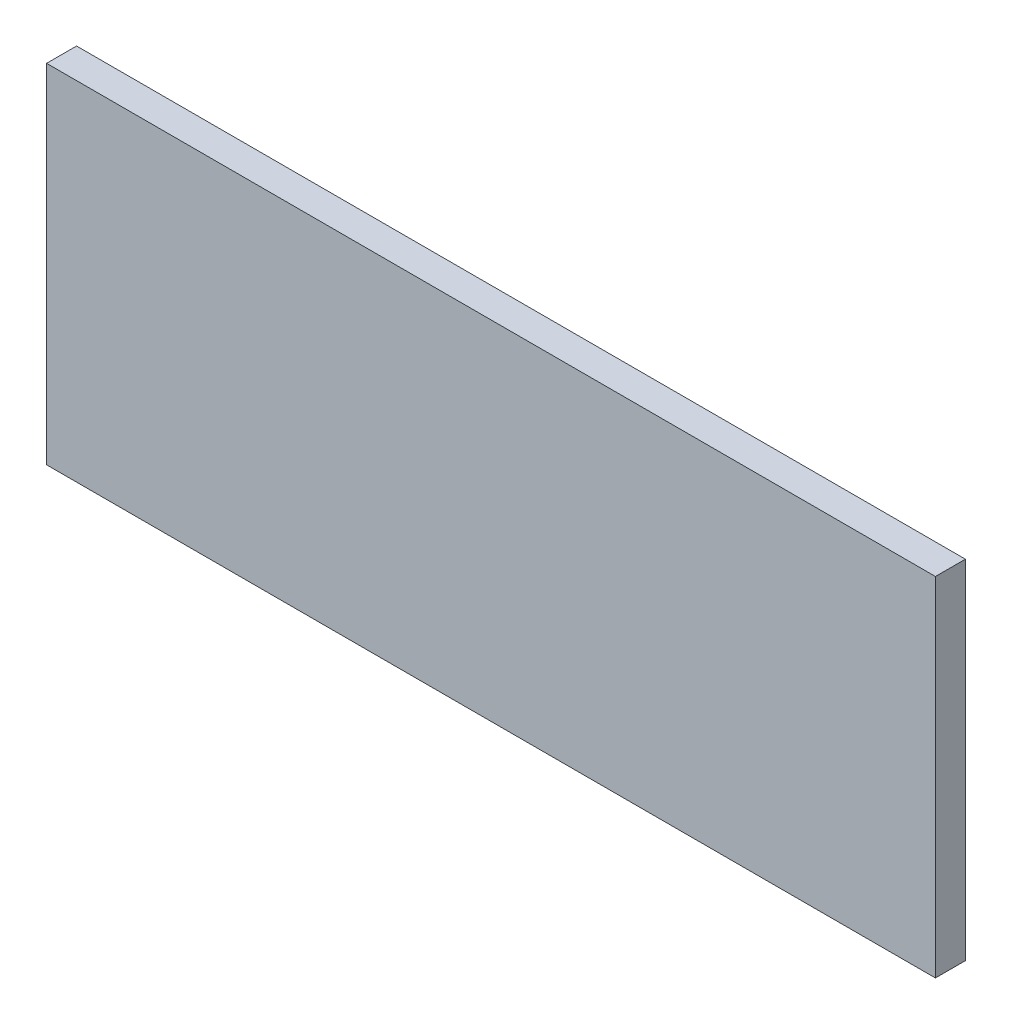
ISO-10303-21;
HEADER;
FILE_DESCRIPTION(('STEP AP214'),'2;1');
FILE_NAME('part.step','',(''),(''),'','','');
FILE_SCHEMA(('AUTOMOTIVE_DESIGN { 1 0 10303 214 1 1 1 1 }'));
ENDSEC;
DATA;
#1=APPLICATION_CONTEXT('core data for automotive mechanical design processes');
#2=APPLICATION_PROTOCOL_DEFINITION('international standard','automotive_design',2000,#1);
#3=PRODUCT_CONTEXT('',#1,'mechanical');
#4=PRODUCT('Part','Part','',(#3));
#5=PRODUCT_RELATED_PRODUCT_CATEGORY('part','',(#4));
#6=PRODUCT_DEFINITION_FORMATION('','',#4);
#7=PRODUCT_DEFINITION_CONTEXT('part definition',#1,'design');
#8=PRODUCT_DEFINITION('design','',#6,#7);
#9=PRODUCT_DEFINITION_SHAPE('','',#8);
#10=(LENGTH_UNIT() NAMED_UNIT(*) SI_UNIT(.MILLI.,.METRE.));
#11=(NAMED_UNIT(*) PLANE_ANGLE_UNIT() SI_UNIT($,.RADIAN.));
#12=(NAMED_UNIT(*) SI_UNIT($,.STERADIAN.) SOLID_ANGLE_UNIT());
#13=UNCERTAINTY_MEASURE_WITH_UNIT(LENGTH_MEASURE(1.E-05),#10,'distance_accuracy_value','');
#14=(GEOMETRIC_REPRESENTATION_CONTEXT(3) GLOBAL_UNCERTAINTY_ASSIGNED_CONTEXT((#13)) GLOBAL_UNIT_ASSIGNED_CONTEXT((#10,
#11,#12)) REPRESENTATION_CONTEXT('',''));
#15=CARTESIAN_POINT('',(0.,0.,0.));
#16=DIRECTION('',(0.,0.,1.));
#17=DIRECTION('',(1.,0.,0.));
#18=AXIS2_PLACEMENT_3D('',#15,#16,#17);
#19=CARTESIAN_POINT('',(148.25,58.,5.));
#20=DIRECTION('',(-1.,0.,0.));
#21=DIRECTION('',(0.,0.,1.));
#22=AXIS2_PLACEMENT_3D('',#19,#20,#21);
#23=PLANE('',#22);
#24=DIRECTION('',(0.,1.,0.));
#25=VECTOR('',#24,1.);
#26=CARTESIAN_POINT('',(148.25,58.,-5.));
#27=LINE('',#26,#25);
#28=CARTESIAN_POINT('',(148.25,-58.,-5.));
#29=VERTEX_POINT('',#28);
#30=CARTESIAN_POINT('',(148.25,58.,-5.));
#31=VERTEX_POINT('',#30);
#32=EDGE_CURVE('E100',#29,#31,#27,.T.);
#33=ORIENTED_EDGE('',*,*,#32,.T.);
#34=DIRECTION('',(0.,0.,-1.));
#35=VECTOR('',#34,1.);
#36=CARTESIAN_POINT('',(148.25,58.,5.));
#37=LINE('',#36,#35);
#38=CARTESIAN_POINT('',(148.25,58.,5.));
#39=VERTEX_POINT('',#38);
#40=EDGE_CURVE('E11',#39,#31,#37,.T.);
#41=ORIENTED_EDGE('',*,*,#40,.F.);
#42=DIRECTION('',(0.,1.,0.));
#43=VECTOR('',#42,1.);
#44=CARTESIAN_POINT('',(148.25,58.,5.));
#45=LINE('',#44,#43);
#46=CARTESIAN_POINT('',(148.25,-58.,5.));
#47=VERTEX_POINT('',#46);
#48=EDGE_CURVE('E88',#47,#39,#45,.T.);
#49=ORIENTED_EDGE('',*,*,#48,.F.);
#50=DIRECTION('',(0.,0.,-1.));
#51=VECTOR('',#50,1.);
#52=CARTESIAN_POINT('',(148.25,-58.,5.));
#53=LINE('',#52,#51);
#54=EDGE_CURVE('E96',#47,#29,#53,.T.);
#55=ORIENTED_EDGE('',*,*,#54,.T.);
#56=EDGE_LOOP('',(#33,#41,#49,#55));
#57=FACE_BOUND('',#56,.T.);
#58=ADVANCED_FACE('F37',(#57),#23,.F.);
#59=CARTESIAN_POINT('',(-148.25,58.,5.));
#60=DIRECTION('',(0.,-1.,0.));
#61=DIRECTION('',(0.,0.,-1.));
#62=AXIS2_PLACEMENT_3D('',#59,#60,#61);
#63=PLANE('',#62);
#64=DIRECTION('',(-1.,0.,0.));
#65=VECTOR('',#64,1.);
#66=CARTESIAN_POINT('',(-148.25,58.,-5.));
#67=LINE('',#66,#65);
#68=CARTESIAN_POINT('',(-148.25,58.,-5.));
#69=VERTEX_POINT('',#68);
#70=EDGE_CURVE('E92',#31,#69,#67,.T.);
#71=ORIENTED_EDGE('',*,*,#70,.T.);
#72=DIRECTION('',(0.,0.,-1.));
#73=VECTOR('',#72,1.);
#74=CARTESIAN_POINT('',(-148.25,58.,5.));
#75=LINE('',#74,#73);
#76=CARTESIAN_POINT('',(-148.25,58.,5.));
#77=VERTEX_POINT('',#76);
#78=EDGE_CURVE('E45',#77,#69,#75,.T.);
#79=ORIENTED_EDGE('',*,*,#78,.F.);
#80=DIRECTION('',(-1.,0.,0.));
#81=VECTOR('',#80,1.);
#82=CARTESIAN_POINT('',(-148.25,58.,5.));
#83=LINE('',#82,#81);
#84=EDGE_CURVE('E83',#39,#77,#83,.T.);
#85=ORIENTED_EDGE('',*,*,#84,.F.);
#86=ORIENTED_EDGE('',*,*,#40,.T.);
#87=EDGE_LOOP('',(#71,#79,#85,#86));
#88=FACE_BOUND('',#87,.T.);
#89=ADVANCED_FACE('F91',(#88),#63,.F.);
#90=CARTESIAN_POINT('',(-148.25,58.,5.));
#91=DIRECTION('',(1.,0.,0.));
#92=DIRECTION('',(0.,0.,-1.));
#93=AXIS2_PLACEMENT_3D('',#90,#91,#92);
#94=PLANE('',#93);
#95=DIRECTION('',(0.,-1.,0.));
#96=VECTOR('',#95,1.);
#97=CARTESIAN_POINT('',(-148.25,58.,-5.));
#98=LINE('',#97,#96);
#99=CARTESIAN_POINT('',(-148.25,-58.,-5.));
#100=VERTEX_POINT('',#99);
#101=EDGE_CURVE('E70',#69,#100,#98,.T.);
#102=ORIENTED_EDGE('',*,*,#101,.T.);
#103=DIRECTION('',(0.,0.,-1.));
#104=VECTOR('',#103,1.);
#105=CARTESIAN_POINT('',(-148.25,-58.,5.));
#106=LINE('',#105,#104);
#107=CARTESIAN_POINT('',(-148.25,-58.,5.));
#108=VERTEX_POINT('',#107);
#109=EDGE_CURVE('E93',#108,#100,#106,.T.);
#110=ORIENTED_EDGE('',*,*,#109,.F.);
#111=DIRECTION('',(0.,-1.,0.));
#112=VECTOR('',#111,1.);
#113=CARTESIAN_POINT('',(-148.25,58.,5.));
#114=LINE('',#113,#112);
#115=EDGE_CURVE('E86',#77,#108,#114,.T.);
#116=ORIENTED_EDGE('',*,*,#115,.F.);
#117=ORIENTED_EDGE('',*,*,#78,.T.);
#118=EDGE_LOOP('',(#102,#110,#116,#117));
#119=FACE_BOUND('',#118,.T.);
#120=ADVANCED_FACE('F94',(#119),#94,.F.);
#121=CARTESIAN_POINT('',(-148.25,-58.,5.));
#122=DIRECTION('',(0.,1.,0.));
#123=DIRECTION('',(0.,0.,1.));
#124=AXIS2_PLACEMENT_3D('',#121,#122,#123);
#125=PLANE('',#124);
#126=DIRECTION('',(1.,0.,0.));
#127=VECTOR('',#126,1.);
#128=CARTESIAN_POINT('',(-148.25,-58.,-5.));
#129=LINE('',#128,#127);
#130=EDGE_CURVE('E76',#100,#29,#129,.T.);
#131=ORIENTED_EDGE('',*,*,#130,.T.);
#132=ORIENTED_EDGE('',*,*,#54,.F.);
#133=DIRECTION('',(1.,0.,0.));
#134=VECTOR('',#133,1.);
#135=CARTESIAN_POINT('',(-148.25,-58.,5.));
#136=LINE('',#135,#134);
#137=EDGE_CURVE('E53',#108,#47,#136,.T.);
#138=ORIENTED_EDGE('',*,*,#137,.F.);
#139=ORIENTED_EDGE('',*,*,#109,.T.);
#140=EDGE_LOOP('',(#131,#132,#138,#139));
#141=FACE_BOUND('',#140,.T.);
#142=ADVANCED_FACE('F107',(#141),#125,.F.);
#143=CARTESIAN_POINT('',(0.,0.,5.));
#144=DIRECTION('',(0.,0.,1.));
#145=DIRECTION('',(1.,0.,0.));
#146=AXIS2_PLACEMENT_3D('',#143,#144,#145);
#147=PLANE('',#146);
#148=ORIENTED_EDGE('',*,*,#48,.T.);
#149=ORIENTED_EDGE('',*,*,#84,.T.);
#150=ORIENTED_EDGE('',*,*,#115,.T.);
#151=ORIENTED_EDGE('',*,*,#137,.T.);
#152=EDGE_LOOP('',(#148,#149,#150,#151));
#153=FACE_BOUND('',#152,.T.);
#154=ADVANCED_FACE('F84',(#153),#147,.T.);
#155=CARTESIAN_POINT('',(0.,0.,-5.));
#156=DIRECTION('',(0.,0.,1.));
#157=DIRECTION('',(1.,0.,0.));
#158=AXIS2_PLACEMENT_3D('',#155,#156,#157);
#159=PLANE('',#158);
#160=ORIENTED_EDGE('',*,*,#32,.F.);
#161=ORIENTED_EDGE('',*,*,#130,.F.);
#162=ORIENTED_EDGE('',*,*,#101,.F.);
#163=ORIENTED_EDGE('',*,*,#70,.F.);
#164=EDGE_LOOP('',(#160,#161,#162,#163));
#165=FACE_BOUND('',#164,.T.);
#166=ADVANCED_FACE('F110',(#165),#159,.F.);
#167=CLOSED_SHELL('',(#58,#89,#120,#142,#154,#166));
#168=MANIFOLD_SOLID_BREP('B2',#167);
#169=ADVANCED_BREP_SHAPE_REPRESENTATION('',(#18,#168),#14);
#170=SHAPE_DEFINITION_REPRESENTATION(#9,#169);
ENDSEC;
END-ISO-10303-21;
